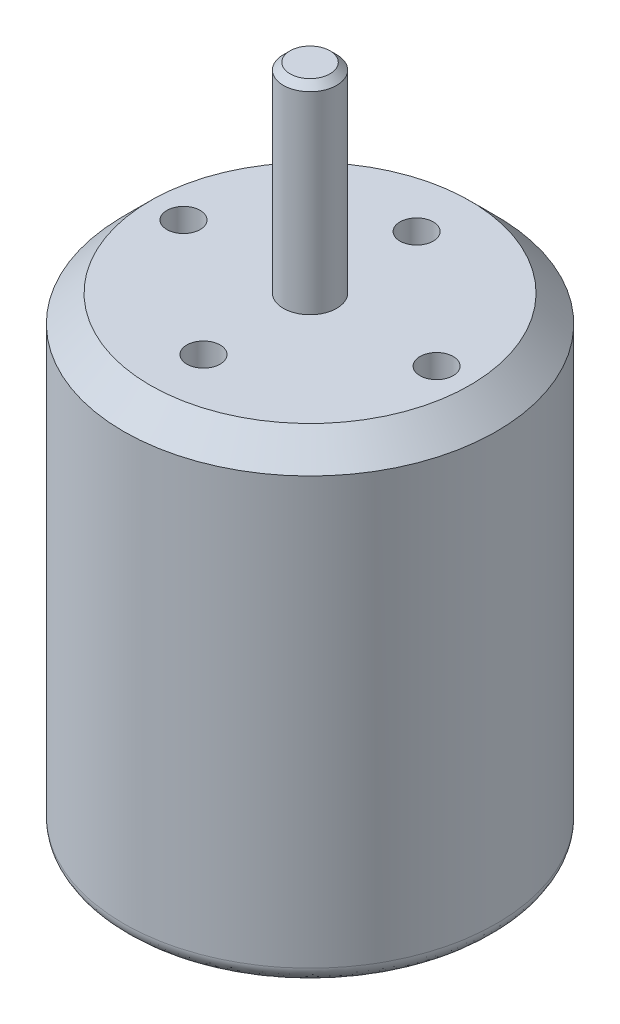
ISO-10303-21;
HEADER;
FILE_DESCRIPTION(('STEP AP214'),'2;1');
FILE_NAME('part.step','',(''),(''),'','','');
FILE_SCHEMA(('AUTOMOTIVE_DESIGN { 1 0 10303 214 1 1 1 1 }'));
ENDSEC;
DATA;
#1=APPLICATION_CONTEXT('core data for automotive mechanical design processes');
#2=APPLICATION_PROTOCOL_DEFINITION('international standard','automotive_design',2000,#1);
#3=PRODUCT_CONTEXT('',#1,'mechanical');
#4=PRODUCT('Part','Part','',(#3));
#5=PRODUCT_RELATED_PRODUCT_CATEGORY('part','',(#4));
#6=PRODUCT_DEFINITION_FORMATION('','',#4);
#7=PRODUCT_DEFINITION_CONTEXT('part definition',#1,'design');
#8=PRODUCT_DEFINITION('design','',#6,#7);
#9=PRODUCT_DEFINITION_SHAPE('','',#8);
#10=(LENGTH_UNIT() NAMED_UNIT(*) SI_UNIT(.MILLI.,.METRE.));
#11=(NAMED_UNIT(*) PLANE_ANGLE_UNIT() SI_UNIT($,.RADIAN.));
#12=(NAMED_UNIT(*) SI_UNIT($,.STERADIAN.) SOLID_ANGLE_UNIT());
#13=UNCERTAINTY_MEASURE_WITH_UNIT(LENGTH_MEASURE(1.E-05),#10,'distance_accuracy_value','');
#14=(GEOMETRIC_REPRESENTATION_CONTEXT(3) GLOBAL_UNCERTAINTY_ASSIGNED_CONTEXT((#13)) GLOBAL_UNIT_ASSIGNED_CONTEXT((#10,
#11,#12)) REPRESENTATION_CONTEXT('',''));
#15=CARTESIAN_POINT('',(0.,0.,0.));
#16=DIRECTION('',(0.,0.,1.));
#17=DIRECTION('',(1.,0.,0.));
#18=AXIS2_PLACEMENT_3D('',#15,#16,#17);
#19=CARTESIAN_POINT('',(0.,-36.,0.));
#20=DIRECTION('',(0.,1.,0.));
#21=DIRECTION('',(0.,0.,1.));
#22=AXIS2_PLACEMENT_3D('',#19,#20,#21);
#23=PLANE('',#22);
#24=CARTESIAN_POINT('',(6.,-36.,0.));
#25=DIRECTION('',(0.,-1.,0.));
#26=DIRECTION('',(0.,0.,-1.));
#27=AXIS2_PLACEMENT_3D('',#24,#25,#26);
#28=CIRCLE('',#27,1.24999999999999);
#29=CARTESIAN_POINT('',(6.,-36.,-1.24999999999999));
#30=VERTEX_POINT('',#29);
#31=EDGE_CURVE('E133',#30,#30,#28,.T.);
#32=ORIENTED_EDGE('',*,*,#31,.F.);
#33=EDGE_LOOP('',(#32));
#34=FACE_BOUND('',#33,.T.);
#35=CARTESIAN_POINT('',(0.,-36.,10.));
#36=CARTESIAN_POINT('',(1.30899693681416,-36.,10.));
#37=CARTESIAN_POINT('',(2.61747884560811,-36.,9.73972676584818));
#38=CARTESIAN_POINT('',(5.03618980169369,-36.,8.73786388437756));
#39=CARTESIAN_POINT('',(6.14546720129179,-36.,7.99666842243973));
#40=CARTESIAN_POINT('',(7.99666842243916,-36.,6.14546720129122));
#41=CARTESIAN_POINT('',(8.73786388437756,-36.,5.0361898016934));
#42=CARTESIAN_POINT('',(9.73972676584818,-36.,2.61747884560839));
#43=CARTESIAN_POINT('',(10.,-36.,1.30899693681409));
#44=CARTESIAN_POINT('',(10.,-36.,-1.30899693681408));
#45=CARTESIAN_POINT('',(9.73972676584818,-36.,-2.6174788456084));
#46=CARTESIAN_POINT('',(8.73786388437756,-36.,-5.03618980169341));
#47=CARTESIAN_POINT('',(7.99666842243823,-36.,-6.14546720129158));
#48=CARTESIAN_POINT('',(6.14546720129271,-36.,-7.99666842243938));
#49=CARTESIAN_POINT('',(5.036189801693,-36.,-8.73786388437753));
#50=CARTESIAN_POINT('',(2.61747884560882,-36.,-9.73972676584819));
#51=CARTESIAN_POINT('',(1.30899693681409,-36.,-10.));
#52=CARTESIAN_POINT('',(-1.30899693681408,-36.,-10.));
#53=CARTESIAN_POINT('',(-2.61747884560823,-36.,-9.73972676584707));
#54=CARTESIAN_POINT('',(-5.03618980169354,-36.,-8.73786388437868));
#55=CARTESIAN_POINT('',(-6.14546720129045,-36.,-7.99666842243937));
#56=CARTESIAN_POINT('',(-7.99666842244051,-36.,-6.14546720129157));
#57=CARTESIAN_POINT('',(-8.73786388437758,-36.,-5.03618980169355));
#58=CARTESIAN_POINT('',(-9.73972676584815,-36.,-2.61747884560827));
#59=CARTESIAN_POINT('',(-10.,-36.,-1.30899693681407));
#60=CARTESIAN_POINT('',(-10.,-36.,1.3089969368141));
#61=CARTESIAN_POINT('',(-9.73972676584816,-36.,2.61747884560825));
#62=CARTESIAN_POINT('',(-8.73786388437759,-36.,5.03618980169352));
#63=CARTESIAN_POINT('',(-7.99666842243896,-36.,6.14546720129199));
#64=CARTESIAN_POINT('',(-6.14546720129203,-36.,7.99666842243892));
#65=CARTESIAN_POINT('',(-5.03618980169355,-36.,8.73786388437758));
#66=CARTESIAN_POINT('',(-2.61747884560827,-36.,9.73972676584815));
#67=CARTESIAN_POINT('',(-1.30899693681417,-36.,10.));
#68=CARTESIAN_POINT('',(0.,-36.,10.));
#69=(BOUNDED_CURVE() B_SPLINE_CURVE(3,(#35,#36,#37,#38,#39,#40,#41,#42,#43,#44,#45,#46,#47,#48,
#49,#50,#51,#52,#53,#54,#55,#56,#57,#58,#59,#60,#61,#62,#63,#64,#65,#66,#67,#68),.UNSPECIFIED.,
.T.,.F.) B_SPLINE_CURVE_WITH_KNOTS((4,2,2,2,2,2,2,2,2,2,2,2,2,2,2,2,4),(0.,0.392699081698724,
0.785398163397448,1.17809724509617,1.5707963267949,1.96349540849362,2.35619449019234,
2.74889357189107,3.14159265358979,3.53429173528852,3.92699081698724,4.31968989868597,
4.71238898038469,5.10508806208341,5.49778714378214,5.89048622548086,6.28318530717959),
.UNSPECIFIED.) CURVE() GEOMETRIC_REPRESENTATION_ITEM() RATIONAL_B_SPLINE_CURVE((1.,1.,1.,1.,1.,
1.,1.,1.,1.,1.,1.,1.,1.,1.,1.,1.,1.,1.,1.,1.,1.,1.,1.,1.,1.,1.,1.,1.,1.,1.,1.,1.,1.,1.)) REPRESENTATION_ITEM(''));
#70=CARTESIAN_POINT('',(0.,-36.,10.));
#71=VERTEX_POINT('',#70);
#72=EDGE_CURVE('E12',#71,#71,#69,.F.);
#73=ORIENTED_EDGE('',*,*,#72,.T.);
#74=EDGE_LOOP('',(#73));
#75=FACE_BOUND('',#74,.T.);
#76=CARTESIAN_POINT('',(0.,-36.,0.));
#77=DIRECTION('',(0.,1.,0.));
#78=DIRECTION('',(0.,0.,1.));
#79=AXIS2_PLACEMENT_3D('',#76,#77,#78);
#80=CIRCLE('',#79,2.);
#81=CARTESIAN_POINT('',(0.,-36.,2.));
#82=VERTEX_POINT('',#81);
#83=EDGE_CURVE('E163',#82,#82,#80,.T.);
#84=ORIENTED_EDGE('',*,*,#83,.T.);
#85=EDGE_LOOP('',(#84));
#86=FACE_BOUND('',#85,.T.);
#87=CARTESIAN_POINT('',(-6.,-36.,0.));
#88=DIRECTION('',(0.,-1.,0.));
#89=DIRECTION('',(0.,0.,-1.));
#90=AXIS2_PLACEMENT_3D('',#87,#88,#89);
#91=CIRCLE('',#90,1.24999999999999);
#92=CARTESIAN_POINT('',(-6.,-36.,-1.24999999999999));
#93=VERTEX_POINT('',#92);
#94=EDGE_CURVE('E127',#93,#93,#91,.T.);
#95=ORIENTED_EDGE('',*,*,#94,.F.);
#96=EDGE_LOOP('',(#95));
#97=FACE_BOUND('',#96,.T.);
#98=CARTESIAN_POINT('',(5.19615242270662,-36.,3.00000000000003));
#99=DIRECTION('',(0.,-1.,0.));
#100=DIRECTION('',(0.,0.,-1.));
#101=AXIS2_PLACEMENT_3D('',#98,#99,#100);
#102=CIRCLE('',#101,1.02499999999999);
#103=CARTESIAN_POINT('',(5.19615242270662,-36.,1.97500000000004));
#104=VERTEX_POINT('',#103);
#105=EDGE_CURVE('E121',#104,#104,#102,.T.);
#106=ORIENTED_EDGE('',*,*,#105,.F.);
#107=EDGE_LOOP('',(#106));
#108=FACE_BOUND('',#107,.T.);
#109=CARTESIAN_POINT('',(-5.19615242270662,-36.,3.00000000000002));
#110=DIRECTION('',(0.,-1.,0.));
#111=DIRECTION('',(0.,0.,-1.));
#112=AXIS2_PLACEMENT_3D('',#109,#110,#111);
#113=CIRCLE('',#112,1.02499999999999);
#114=CARTESIAN_POINT('',(-5.19615242270662,-36.,1.97500000000003));
#115=VERTEX_POINT('',#114);
#116=EDGE_CURVE('E110',#115,#115,#113,.T.);
#117=ORIENTED_EDGE('',*,*,#116,.F.);
#118=EDGE_LOOP('',(#117));
#119=FACE_BOUND('',#118,.T.);
#120=CARTESIAN_POINT('',(0.,-36.,-6.));
#121=DIRECTION('',(0.,-1.,0.));
#122=DIRECTION('',(0.,0.,-1.));
#123=AXIS2_PLACEMENT_3D('',#120,#121,#122);
#124=CIRCLE('',#123,1.02499999999999);
#125=CARTESIAN_POINT('',(0.,-36.,-7.02499999999999));
#126=VERTEX_POINT('',#125);
#127=EDGE_CURVE('E111',#126,#126,#124,.T.);
#128=ORIENTED_EDGE('',*,*,#127,.F.);
#129=EDGE_LOOP('',(#128));
#130=FACE_BOUND('',#129,.T.);
#131=ADVANCED_FACE('F58',(#34,#75,#86,#97,#108,#119,#130),#23,.F.);
#132=CARTESIAN_POINT('',(0.,-36.,0.));
#133=DIRECTION('',(0.,1.,0.));
#134=DIRECTION('',(0.,0.,1.));
#135=AXIS2_PLACEMENT_3D('',#132,#133,#134);
#136=CYLINDRICAL_SURFACE('',#135,14.);
#137=CARTESIAN_POINT('',(0.,-34.,14.));
#138=CARTESIAN_POINT('',(-1.83259571153983,-34.,14.));
#139=CARTESIAN_POINT('',(-3.66447038385156,-34.,13.6356174721877));
#140=CARTESIAN_POINT('',(-7.05066572237099,-34.,12.2330094381284));
#141=CARTESIAN_POINT('',(-8.60365408180828,-34.,11.1953357914151));
#142=CARTESIAN_POINT('',(-11.1953357914151,-34.,8.60365408180821));
#143=CARTESIAN_POINT('',(-12.2330094381284,-34.,7.05066572237095));
#144=CARTESIAN_POINT('',(-13.6356174721877,-34.,3.66447038385152));
#145=CARTESIAN_POINT('',(-14.,-34.,1.83259571153974));
#146=CARTESIAN_POINT('',(-14.,-34.,-1.8325957115397));
#147=CARTESIAN_POINT('',(-13.6356174721877,-34.,-3.66447038385156));
#148=CARTESIAN_POINT('',(-12.2330094381284,-34.,-7.05066572237099));
#149=CARTESIAN_POINT('',(-11.1953357914156,-34.,-8.60365408180775));
#150=CARTESIAN_POINT('',(-8.60365408180776,-34.,-11.1953357914156));
#151=CARTESIAN_POINT('',(-7.05066572237014,-34.,-12.2330094381287));
#152=CARTESIAN_POINT('',(-3.66447038385234,-34.,-13.6356174721873));
#153=CARTESIAN_POINT('',(-1.83259571153972,-34.,-14.));
#154=CARTESIAN_POINT('',(1.83259571153972,-34.,-14.));
#155=CARTESIAN_POINT('',(3.66447038385246,-34.,-13.6356174721873));
#156=CARTESIAN_POINT('',(7.05066572237009,-34.,-12.2330094381287));
#157=CARTESIAN_POINT('',(8.60365408180888,-34.,-11.1953357914145));
#158=CARTESIAN_POINT('',(11.1953357914144,-34.,-8.6036540818089));
#159=CARTESIAN_POINT('',(12.2330094381285,-34.,-7.05066572237053));
#160=CARTESIAN_POINT('',(13.6356174721875,-34.,-3.66447038385199));
#161=CARTESIAN_POINT('',(14.,-34.,-1.83259571153972));
#162=CARTESIAN_POINT('',(14.,-34.,1.83259571153972));
#163=CARTESIAN_POINT('',(13.6356174721875,-34.,3.66447038385198));
#164=CARTESIAN_POINT('',(12.2330094381286,-34.,7.05066572237052));
#165=CARTESIAN_POINT('',(11.1953357914151,-34.,8.60365408180828));
#166=CARTESIAN_POINT('',(8.60365408180828,-34.,11.1953357914151));
#167=CARTESIAN_POINT('',(7.05066572237149,-34.,12.2330094381281));
#168=CARTESIAN_POINT('',(3.66447038385102,-34.,13.6356174721879));
#169=CARTESIAN_POINT('',(1.83259571153983,-34.,14.));
#170=CARTESIAN_POINT('',(0.,-34.,14.));
#171=(BOUNDED_CURVE() B_SPLINE_CURVE(3,(#137,#138,#139,#140,#141,#142,#143,#144,#145,#146,#147,
#148,#149,#150,#151,#152,#153,#154,#155,#156,#157,#158,#159,#160,#161,#162,#163,#164,#165,#166,
#167,#168,#169,#170),.UNSPECIFIED.,.T.,.F.) B_SPLINE_CURVE_WITH_KNOTS((4,2,2,2,2,2,2,2,2,2,2,2,
2,2,2,2,4),(0.,0.392699081698725,0.785398163397448,1.17809724509617,1.5707963267949,
1.96349540849362,2.35619449019234,2.74889357189107,3.14159265358979,3.53429173528852,
3.92699081698724,4.31968989868597,4.71238898038469,5.10508806208341,5.49778714378214,
5.89048622548086,6.28318530717959),
.UNSPECIFIED.) CURVE() GEOMETRIC_REPRESENTATION_ITEM() RATIONAL_B_SPLINE_CURVE((1.,1.,1.,1.,1.,
1.,1.,1.,1.,1.,1.,1.,1.,1.,1.,1.,1.,1.,1.,1.,1.,1.,1.,1.,1.,1.,1.,1.,1.,1.,1.,1.,1.,1.)) REPRESENTATION_ITEM(''));
#172=CARTESIAN_POINT('',(0.,-34.,14.));
#173=VERTEX_POINT('',#172);
#174=EDGE_CURVE('E72',#173,#173,#171,.F.);
#175=ORIENTED_EDGE('',*,*,#174,.T.);
#176=EDGE_LOOP('',(#175));
#177=FACE_BOUND('',#176,.T.);
#178=CARTESIAN_POINT('',(0.,-1.99999999999999,0.));
#179=DIRECTION('',(0.,1.,0.));
#180=DIRECTION('',(0.,0.,1.));
#181=AXIS2_PLACEMENT_3D('',#178,#179,#180);
#182=CIRCLE('',#181,14.);
#183=CARTESIAN_POINT('',(0.,-1.99999999999999,14.));
#184=VERTEX_POINT('',#183);
#185=EDGE_CURVE('E184',#184,#184,#182,.F.);
#186=ORIENTED_EDGE('',*,*,#185,.T.);
#187=EDGE_LOOP('',(#186));
#188=FACE_BOUND('',#187,.T.);
#189=ADVANCED_FACE('F196',(#177,#188),#136,.T.);
#190=CARTESIAN_POINT('',(0.,0.,0.));
#191=DIRECTION('',(0.,1.,0.));
#192=DIRECTION('',(0.,0.,1.));
#193=AXIS2_PLACEMENT_3D('',#190,#191,#192);
#194=PLANE('',#193);
#195=CARTESIAN_POINT('',(0.,0.,8.));
#196=DIRECTION('',(0.,1.,0.));
#197=DIRECTION('',(0.,0.,1.));
#198=AXIS2_PLACEMENT_3D('',#195,#196,#197);
#199=CIRCLE('',#198,1.24999999999999);
#200=CARTESIAN_POINT('',(0.,0.,9.24999999999999));
#201=VERTEX_POINT('',#200);
#202=EDGE_CURVE('E139',#201,#201,#199,.T.);
#203=ORIENTED_EDGE('',*,*,#202,.F.);
#204=EDGE_LOOP('',(#203));
#205=FACE_BOUND('',#204,.T.);
#206=CARTESIAN_POINT('',(-9.5,0.,0.));
#207=DIRECTION('',(0.,1.,0.));
#208=DIRECTION('',(0.,0.,1.));
#209=AXIS2_PLACEMENT_3D('',#206,#207,#208);
#210=CIRCLE('',#209,1.24999999999999);
#211=CARTESIAN_POINT('',(-9.5,0.,1.24999999999999));
#212=VERTEX_POINT('',#211);
#213=EDGE_CURVE('E145',#212,#212,#210,.T.);
#214=ORIENTED_EDGE('',*,*,#213,.F.);
#215=EDGE_LOOP('',(#214));
#216=FACE_BOUND('',#215,.T.);
#217=CARTESIAN_POINT('',(0.,0.,-8.));
#218=DIRECTION('',(0.,1.,0.));
#219=DIRECTION('',(0.,0.,1.));
#220=AXIS2_PLACEMENT_3D('',#217,#218,#219);
#221=CIRCLE('',#220,1.24999999999999);
#222=CARTESIAN_POINT('',(0.,0.,-6.75000000000001));
#223=VERTEX_POINT('',#222);
#224=EDGE_CURVE('E151',#223,#223,#221,.T.);
#225=ORIENTED_EDGE('',*,*,#224,.F.);
#226=EDGE_LOOP('',(#225));
#227=FACE_BOUND('',#226,.T.);
#228=CARTESIAN_POINT('',(9.5,0.,0.));
#229=DIRECTION('',(0.,1.,0.));
#230=DIRECTION('',(0.,0.,1.));
#231=AXIS2_PLACEMENT_3D('',#228,#229,#230);
#232=CIRCLE('',#231,1.24999999999999);
#233=CARTESIAN_POINT('',(9.5,0.,1.24999999999999));
#234=VERTEX_POINT('',#233);
#235=EDGE_CURVE('E157',#234,#234,#232,.T.);
#236=ORIENTED_EDGE('',*,*,#235,.F.);
#237=EDGE_LOOP('',(#236));
#238=FACE_BOUND('',#237,.T.);
#239=CARTESIAN_POINT('',(0.,0.,0.));
#240=DIRECTION('',(0.,1.,0.));
#241=DIRECTION('',(0.,0.,1.));
#242=AXIS2_PLACEMENT_3D('',#239,#240,#241);
#243=CIRCLE('',#242,12.);
#244=CARTESIAN_POINT('',(0.,0.,12.));
#245=VERTEX_POINT('',#244);
#246=EDGE_CURVE('E181',#245,#245,#243,.T.);
#247=ORIENTED_EDGE('',*,*,#246,.T.);
#248=EDGE_LOOP('',(#247));
#249=FACE_BOUND('',#248,.T.);
#250=CARTESIAN_POINT('',(0.,0.,0.));
#251=DIRECTION('',(0.,1.,0.));
#252=DIRECTION('',(0.,0.,1.));
#253=AXIS2_PLACEMENT_3D('',#250,#251,#252);
#254=CIRCLE('',#253,2.);
#255=CARTESIAN_POINT('',(0.,0.,2.));
#256=VERTEX_POINT('',#255);
#257=EDGE_CURVE('E166',#256,#256,#254,.T.);
#258=ORIENTED_EDGE('',*,*,#257,.F.);
#259=EDGE_LOOP('',(#258));
#260=FACE_BOUND('',#259,.T.);
#261=ADVANCED_FACE('F206',(#205,#216,#227,#238,#249,#260),#194,.T.);
#262=CARTESIAN_POINT('',(0.,15.,0.));
#263=DIRECTION('',(0.,-1.,0.));
#264=DIRECTION('',(0.,0.,-1.));
#265=AXIS2_PLACEMENT_3D('',#262,#263,#264);
#266=CYLINDRICAL_SURFACE('',#265,2.);
#267=CARTESIAN_POINT('',(0.,14.5,0.));
#268=DIRECTION('',(0.,1.,0.));
#269=DIRECTION('',(0.,0.,1.));
#270=AXIS2_PLACEMENT_3D('',#267,#268,#269);
#271=CIRCLE('',#270,2.);
#272=CARTESIAN_POINT('',(0.,14.5,2.));
#273=VERTEX_POINT('',#272);
#274=EDGE_CURVE('E178',#273,#273,#271,.F.);
#275=ORIENTED_EDGE('',*,*,#274,.T.);
#276=EDGE_LOOP('',(#275));
#277=FACE_BOUND('',#276,.T.);
#278=ORIENTED_EDGE('',*,*,#257,.T.);
#279=EDGE_LOOP('',(#278));
#280=FACE_BOUND('',#279,.T.);
#281=ADVANCED_FACE('F243',(#277,#280),#266,.T.);
#282=CARTESIAN_POINT('',(0.,15.,0.));
#283=DIRECTION('',(0.,1.,0.));
#284=DIRECTION('',(0.,0.,1.));
#285=AXIS2_PLACEMENT_3D('',#282,#283,#284);
#286=PLANE('',#285);
#287=CARTESIAN_POINT('',(0.,15.,0.));
#288=DIRECTION('',(0.,1.,0.));
#289=DIRECTION('',(0.,0.,1.));
#290=AXIS2_PLACEMENT_3D('',#287,#288,#289);
#291=CIRCLE('',#290,1.50000000000002);
#292=CARTESIAN_POINT('',(0.,15.,1.50000000000002));
#293=VERTEX_POINT('',#292);
#294=EDGE_CURVE('E175',#293,#293,#291,.T.);
#295=ORIENTED_EDGE('',*,*,#294,.T.);
#296=EDGE_LOOP('',(#295));
#297=FACE_BOUND('',#296,.T.);
#298=ADVANCED_FACE('F344',(#297),#286,.T.);
#299=CARTESIAN_POINT('',(0.,-38.,0.));
#300=DIRECTION('',(0.,1.,0.));
#301=DIRECTION('',(0.,0.,1.));
#302=AXIS2_PLACEMENT_3D('',#299,#300,#301);
#303=CYLINDRICAL_SURFACE('',#302,2.);
#304=CARTESIAN_POINT('',(0.,-37.5,0.));
#305=DIRECTION('',(0.,1.,0.));
#306=DIRECTION('',(0.,0.,1.));
#307=AXIS2_PLACEMENT_3D('',#304,#305,#306);
#308=CIRCLE('',#307,2.);
#309=CARTESIAN_POINT('',(0.,-37.5,2.));
#310=VERTEX_POINT('',#309);
#311=EDGE_CURVE('E169',#310,#310,#308,.T.);
#312=ORIENTED_EDGE('',*,*,#311,.T.);
#313=EDGE_LOOP('',(#312));
#314=FACE_BOUND('',#313,.T.);
#315=ORIENTED_EDGE('',*,*,#83,.F.);
#316=EDGE_LOOP('',(#315));
#317=FACE_BOUND('',#316,.T.);
#318=ADVANCED_FACE('F341',(#314,#317),#303,.T.);
#319=CARTESIAN_POINT('',(0.,-38.,0.));
#320=DIRECTION('',(0.,1.,0.));
#321=DIRECTION('',(0.,0.,1.));
#322=AXIS2_PLACEMENT_3D('',#319,#320,#321);
#323=PLANE('',#322);
#324=CARTESIAN_POINT('',(0.,-38.,0.));
#325=DIRECTION('',(0.,1.,0.));
#326=DIRECTION('',(0.,0.,1.));
#327=AXIS2_PLACEMENT_3D('',#324,#325,#326);
#328=CIRCLE('',#327,1.49999999999999);
#329=CARTESIAN_POINT('',(0.,-38.,1.49999999999999));
#330=VERTEX_POINT('',#329);
#331=EDGE_CURVE('E172',#330,#330,#328,.F.);
#332=ORIENTED_EDGE('',*,*,#331,.T.);
#333=EDGE_LOOP('',(#332));
#334=FACE_BOUND('',#333,.T.);
#335=ADVANCED_FACE('F216',(#334),#323,.F.);
#336=CARTESIAN_POINT('',(0.,-37.5,0.));
#337=DIRECTION('',(0.,1.,0.));
#338=DIRECTION('',(0.,0.,1.));
#339=AXIS2_PLACEMENT_3D('',#336,#337,#338);
#340=CONICAL_SURFACE('',#339,2.,0.785398163397454);
#341=ORIENTED_EDGE('',*,*,#331,.F.);
#342=EDGE_LOOP('',(#341));
#343=FACE_BOUND('',#342,.T.);
#344=ORIENTED_EDGE('',*,*,#311,.F.);
#345=EDGE_LOOP('',(#344));
#346=FACE_BOUND('',#345,.T.);
#347=ADVANCED_FACE('F209',(#343,#346),#340,.T.);
#348=CARTESIAN_POINT('',(0.,15.,0.));
#349=DIRECTION('',(0.,-1.,0.));
#350=DIRECTION('',(0.,0.,-1.));
#351=AXIS2_PLACEMENT_3D('',#348,#349,#350);
#352=CONICAL_SURFACE('',#351,1.50000000000002,0.785398163397442);
#353=ORIENTED_EDGE('',*,*,#274,.F.);
#354=EDGE_LOOP('',(#353));
#355=FACE_BOUND('',#354,.T.);
#356=ORIENTED_EDGE('',*,*,#294,.F.);
#357=EDGE_LOOP('',(#356));
#358=FACE_BOUND('',#357,.T.);
#359=ADVANCED_FACE('F215',(#355,#358),#352,.T.);
#360=CARTESIAN_POINT('',(0.,0.,0.));
#361=DIRECTION('',(0.,-1.,0.));
#362=DIRECTION('',(0.,0.,-1.));
#363=AXIS2_PLACEMENT_3D('',#360,#361,#362);
#364=CONICAL_SURFACE('',#363,12.,0.785398163397449);
#365=ORIENTED_EDGE('',*,*,#185,.F.);
#366=EDGE_LOOP('',(#365));
#367=FACE_BOUND('',#366,.T.);
#368=ORIENTED_EDGE('',*,*,#246,.F.);
#369=EDGE_LOOP('',(#368));
#370=FACE_BOUND('',#369,.T.);
#371=ADVANCED_FACE('F222',(#367,#370),#364,.T.);
#372=CARTESIAN_POINT('',(0.,-34.,14.));
#373=CARTESIAN_POINT('',(1.83259571153983,-34.,14.));
#374=CARTESIAN_POINT('',(3.66447038385102,-34.,13.6356174721879));
#375=CARTESIAN_POINT('',(7.05066572237149,-34.,12.2330094381281));
#376=CARTESIAN_POINT('',(8.60365408180828,-34.,11.1953357914151));
#377=CARTESIAN_POINT('',(11.1953357914151,-34.,8.60365408180828));
#378=CARTESIAN_POINT('',(12.2330094381286,-34.,7.05066572237052));
#379=CARTESIAN_POINT('',(13.6356174721875,-34.,3.66447038385198));
#380=CARTESIAN_POINT('',(14.,-34.,1.83259571153972));
#381=CARTESIAN_POINT('',(14.,-34.,-1.83259571153972));
#382=CARTESIAN_POINT('',(13.6356174721875,-34.,-3.66447038385199));
#383=CARTESIAN_POINT('',(12.2330094381285,-34.,-7.05066572237053));
#384=CARTESIAN_POINT('',(11.1953357914144,-34.,-8.6036540818089));
#385=CARTESIAN_POINT('',(8.60365408180888,-34.,-11.1953357914145));
#386=CARTESIAN_POINT('',(7.05066572237009,-34.,-12.2330094381287));
#387=CARTESIAN_POINT('',(3.66447038385246,-34.,-13.6356174721873));
#388=CARTESIAN_POINT('',(1.83259571153972,-34.,-14.));
#389=CARTESIAN_POINT('',(-1.83259571153972,-34.,-14.));
#390=CARTESIAN_POINT('',(-3.66447038385234,-34.,-13.6356174721873));
#391=CARTESIAN_POINT('',(-7.05066572237014,-34.,-12.2330094381287));
#392=CARTESIAN_POINT('',(-8.60365408180776,-34.,-11.1953357914156));
#393=CARTESIAN_POINT('',(-11.1953357914156,-34.,-8.60365408180775));
#394=CARTESIAN_POINT('',(-12.2330094381284,-34.,-7.05066572237099));
#395=CARTESIAN_POINT('',(-13.6356174721877,-34.,-3.66447038385156));
#396=CARTESIAN_POINT('',(-14.,-34.,-1.8325957115397));
#397=CARTESIAN_POINT('',(-14.,-34.,1.83259571153974));
#398=CARTESIAN_POINT('',(-13.6356174721877,-34.,3.66447038385152));
#399=CARTESIAN_POINT('',(-12.2330094381284,-34.,7.05066572237095));
#400=CARTESIAN_POINT('',(-11.1953357914151,-34.,8.60365408180821));
#401=CARTESIAN_POINT('',(-8.60365408180828,-34.,11.1953357914151));
#402=CARTESIAN_POINT('',(-7.05066572237099,-34.,12.2330094381284));
#403=CARTESIAN_POINT('',(-3.66447038385156,-34.,13.6356174721877));
#404=CARTESIAN_POINT('',(-1.83259571153983,-34.,14.));
#405=CARTESIAN_POINT('',(0.,-34.,14.));
#406=CARTESIAN_POINT('',(0.,-36.,14.));
#407=CARTESIAN_POINT('',(1.83259571153983,-36.,14.));
#408=CARTESIAN_POINT('',(3.66447038385084,-36.,13.6356174721874));
#409=CARTESIAN_POINT('',(7.05066572237167,-36.,12.2330094381286));
#410=CARTESIAN_POINT('',(8.60365408180771,-36.,11.1953357914145));
#411=CARTESIAN_POINT('',(11.1953357914156,-36.,8.60365408180885));
#412=CARTESIAN_POINT('',(12.2330094381286,-36.,7.05066572237053));
#413=CARTESIAN_POINT('',(13.6356174721874,-36.,3.66447038385197));
#414=CARTESIAN_POINT('',(14.,-36.,1.83259571153972));
#415=CARTESIAN_POINT('',(14.,-36.,-1.83259571153972));
#416=CARTESIAN_POINT('',(13.6356174721874,-36.,-3.66447038385198));
#417=CARTESIAN_POINT('',(12.2330094381286,-36.,-7.05066572237054));
#418=CARTESIAN_POINT('',(11.195335791415,-36.,-8.60365408180833));
#419=CARTESIAN_POINT('',(8.60365408180831,-36.,-11.195335791415));
#420=CARTESIAN_POINT('',(7.05066572236964,-36.,-12.233009438129));
#421=CARTESIAN_POINT('',(3.66447038385292,-36.,-13.635617472187));
#422=CARTESIAN_POINT('',(1.83259571153972,-36.,-14.));
#423=CARTESIAN_POINT('',(-1.83259571153972,-36.,-14.));
#424=CARTESIAN_POINT('',(-3.66447038385174,-36.,-13.6356174721859));
#425=CARTESIAN_POINT('',(-7.05066572237073,-36.,-12.2330094381301));
#426=CARTESIAN_POINT('',(-8.60365408180719,-36.,-11.1953357914161));
#427=CARTESIAN_POINT('',(-11.1953357914162,-36.,-8.60365408180718));
#428=CARTESIAN_POINT('',(-12.2330094381282,-36.,-7.05066572237091));
#429=CARTESIAN_POINT('',(-13.6356174721879,-36.,-3.66447038385164));
#430=CARTESIAN_POINT('',(-14.,-36.,-1.8325957115397));
#431=CARTESIAN_POINT('',(-14.,-36.,1.83259571153974));
#432=CARTESIAN_POINT('',(-13.6356174721879,-36.,3.6644703838516));
#433=CARTESIAN_POINT('',(-12.2330094381282,-36.,7.05066572237087));
#434=CARTESIAN_POINT('',(-11.1953357914151,-36.,8.60365408180822));
#435=CARTESIAN_POINT('',(-8.60365408180827,-36.,11.1953357914151));
#436=CARTESIAN_POINT('',(-7.05066572237091,-36.,12.2330094381282));
#437=CARTESIAN_POINT('',(-3.66447038385164,-36.,13.6356174721879));
#438=CARTESIAN_POINT('',(-1.83259571153983,-36.,14.));
#439=CARTESIAN_POINT('',(0.,-36.,14.));
#440=CARTESIAN_POINT('',(0.,-36.,10.));
#441=CARTESIAN_POINT('',(1.30899693681416,-36.,10.));
#442=CARTESIAN_POINT('',(2.61747884560811,-36.,9.73972676584818));
#443=CARTESIAN_POINT('',(5.03618980169369,-36.,8.73786388437756));
#444=CARTESIAN_POINT('',(6.14546720129179,-36.,7.99666842243973));
#445=CARTESIAN_POINT('',(7.99666842243916,-36.,6.14546720129122));
#446=CARTESIAN_POINT('',(8.73786388437756,-36.,5.0361898016934));
#447=CARTESIAN_POINT('',(9.73972676584818,-36.,2.61747884560839));
#448=CARTESIAN_POINT('',(10.,-36.,1.30899693681409));
#449=CARTESIAN_POINT('',(10.,-36.,-1.30899693681408));
#450=CARTESIAN_POINT('',(9.73972676584818,-36.,-2.6174788456084));
#451=CARTESIAN_POINT('',(8.73786388437756,-36.,-5.03618980169341));
#452=CARTESIAN_POINT('',(7.99666842243823,-36.,-6.14546720129158));
#453=CARTESIAN_POINT('',(6.14546720129271,-36.,-7.99666842243938));
#454=CARTESIAN_POINT('',(5.036189801693,-36.,-8.73786388437753));
#455=CARTESIAN_POINT('',(2.61747884560882,-36.,-9.73972676584819));
#456=CARTESIAN_POINT('',(1.30899693681409,-36.,-10.));
#457=CARTESIAN_POINT('',(-1.30899693681408,-36.,-10.));
#458=CARTESIAN_POINT('',(-2.61747884560823,-36.,-9.73972676584707));
#459=CARTESIAN_POINT('',(-5.03618980169354,-36.,-8.73786388437868));
#460=CARTESIAN_POINT('',(-6.14546720129045,-36.,-7.99666842243937));
#461=CARTESIAN_POINT('',(-7.99666842244051,-36.,-6.14546720129157));
#462=CARTESIAN_POINT('',(-8.73786388437758,-36.,-5.03618980169355));
#463=CARTESIAN_POINT('',(-9.73972676584815,-36.,-2.61747884560827));
#464=CARTESIAN_POINT('',(-10.,-36.,-1.30899693681407));
#465=CARTESIAN_POINT('',(-10.,-36.,1.3089969368141));
#466=CARTESIAN_POINT('',(-9.73972676584816,-36.,2.61747884560825));
#467=CARTESIAN_POINT('',(-8.73786388437759,-36.,5.03618980169352));
#468=CARTESIAN_POINT('',(-7.99666842243896,-36.,6.14546720129199));
#469=CARTESIAN_POINT('',(-6.14546720129203,-36.,7.99666842243892));
#470=CARTESIAN_POINT('',(-5.03618980169355,-36.,8.73786388437758));
#471=CARTESIAN_POINT('',(-2.61747884560827,-36.,9.73972676584815));
#472=CARTESIAN_POINT('',(-1.30899693681417,-36.,10.));
#473=CARTESIAN_POINT('',(0.,-36.,10.));
#474=(BOUNDED_SURFACE() B_SPLINE_SURFACE(2,3,((#372,#373,#374,#375,#376,#377,#378,#379,#380,
#381,#382,#383,#384,#385,#386,#387,#388,#389,#390,#391,#392,#393,#394,#395,#396,#397,#398,#399,
#400,#401,#402,#403,#404,#405),(#406,#407,#408,#409,#410,#411,#412,#413,#414,#415,#416,#417,
#418,#419,#420,#421,#422,#423,#424,#425,#426,#427,#428,#429,#430,#431,#432,#433,#434,#435,#436,
#437,#438,#439),(#440,#441,#442,#443,#444,#445,#446,#447,#448,#449,#450,#451,#452,#453,#454,
#455,#456,#457,#458,#459,#460,#461,#462,#463,#464,#465,#466,#467,#468,#469,#470,#471,#472,
#473)),.UNSPECIFIED.,.F.,.T.,.F.) B_SPLINE_SURFACE_WITH_KNOTS((3,3),(4,2,2,2,2,2,2,2,2,2,2,2,2,
2,2,2,4),(0.,1.),(0.,0.392699081698724,0.785398163397448,1.17809724509617,1.5707963267949,
1.96349540849362,2.35619449019234,2.74889357189107,3.14159265358979,3.53429173528852,
3.92699081698724,4.31968989868597,4.71238898038469,5.10508806208341,5.49778714378214,
5.89048622548086,6.28318530717959),
.UNSPECIFIED.) GEOMETRIC_REPRESENTATION_ITEM() RATIONAL_B_SPLINE_SURFACE(((1.,1.,1.,1.,1.,1.,1.,
1.,1.,1.,1.,1.,1.,1.,1.,1.,1.,1.,1.,1.,1.,1.,1.,1.,1.,1.,1.,1.,1.,1.,1.,1.,1.,1.),
(0.707106781186548,0.707106781186548,0.707106781186548,0.707106781186548,0.707106781186548,
0.707106781186548,0.707106781186548,0.707106781186548,0.707106781186548,0.707106781186548,
0.707106781186548,0.707106781186548,0.707106781186548,0.707106781186548,0.707106781186548,
0.707106781186548,0.707106781186548,0.707106781186548,0.707106781186548,0.707106781186548,
0.707106781186548,0.707106781186548,0.707106781186548,0.707106781186548,0.707106781186548,
0.707106781186548,0.707106781186548,0.707106781186548,0.707106781186548,0.707106781186548,
0.707106781186548,0.707106781186548,0.707106781186548,0.707106781186548),(1.,1.,1.,1.,1.,1.,1.,
1.,1.,1.,1.,1.,1.,1.,1.,1.,1.,1.,1.,1.,1.,1.,1.,1.,1.,1.,1.,1.,1.,1.,1.,1.,1.,1.))) REPRESENTATION_ITEM('') SURFACE());
#475=ORIENTED_EDGE('',*,*,#72,.F.);
#476=EDGE_LOOP('',(#475));
#477=FACE_BOUND('',#476,.T.);
#478=ORIENTED_EDGE('',*,*,#174,.F.);
#479=EDGE_LOOP('',(#478));
#480=FACE_BOUND('',#479,.T.);
#481=ADVANCED_FACE('F61',(#477,#480),#474,.T.);
#482=CARTESIAN_POINT('',(9.5,-4.,0.));
#483=DIRECTION('',(0.,1.,0.));
#484=DIRECTION('',(0.,0.,1.));
#485=AXIS2_PLACEMENT_3D('',#482,#483,#484);
#486=CONICAL_SURFACE('',#485,1.24999999999999,1.02974425867665);
#487=CARTESIAN_POINT('',(9.5,-4.75107577378445,0.));
#488=VERTEX_POINT('',#487);
#489=VERTEX_LOOP('',#488);
#490=FACE_BOUND('',#489,.T.);
#491=CARTESIAN_POINT('',(9.5,-4.,0.));
#492=DIRECTION('',(0.,1.,0.));
#493=DIRECTION('',(0.,0.,1.));
#494=AXIS2_PLACEMENT_3D('',#491,#492,#493);
#495=CIRCLE('',#494,1.24999999999999);
#496=CARTESIAN_POINT('',(9.5,-4.,1.24999999999999));
#497=VERTEX_POINT('',#496);
#498=EDGE_CURVE('E160',#497,#497,#495,.T.);
#499=ORIENTED_EDGE('',*,*,#498,.T.);
#500=EDGE_LOOP('',(#499));
#501=FACE_BOUND('',#500,.T.);
#502=ADVANCED_FACE('F231',(#490,#501),#486,.F.);
#503=CARTESIAN_POINT('',(9.5,0.,0.));
#504=DIRECTION('',(0.,1.,0.));
#505=DIRECTION('',(0.,0.,1.));
#506=AXIS2_PLACEMENT_3D('',#503,#504,#505);
#507=CYLINDRICAL_SURFACE('',#506,1.24999999999999);
#508=ORIENTED_EDGE('',*,*,#498,.F.);
#509=EDGE_LOOP('',(#508));
#510=FACE_BOUND('',#509,.T.);
#511=ORIENTED_EDGE('',*,*,#235,.T.);
#512=EDGE_LOOP('',(#511));
#513=FACE_BOUND('',#512,.T.);
#514=ADVANCED_FACE('F333',(#510,#513),#507,.F.);
#515=CARTESIAN_POINT('',(0.,-4.,-8.));
#516=DIRECTION('',(0.,1.,0.));
#517=DIRECTION('',(0.,0.,1.));
#518=AXIS2_PLACEMENT_3D('',#515,#516,#517);
#519=CONICAL_SURFACE('',#518,1.24999999999999,1.02974425867665);
#520=CARTESIAN_POINT('',(0.,-4.75107577378445,-8.));
#521=VERTEX_POINT('',#520);
#522=VERTEX_LOOP('',#521);
#523=FACE_BOUND('',#522,.T.);
#524=CARTESIAN_POINT('',(0.,-4.,-8.));
#525=DIRECTION('',(0.,1.,0.));
#526=DIRECTION('',(0.,0.,1.));
#527=AXIS2_PLACEMENT_3D('',#524,#525,#526);
#528=CIRCLE('',#527,1.24999999999999);
#529=CARTESIAN_POINT('',(0.,-4.,-6.75000000000001));
#530=VERTEX_POINT('',#529);
#531=EDGE_CURVE('E154',#530,#530,#528,.T.);
#532=ORIENTED_EDGE('',*,*,#531,.T.);
#533=EDGE_LOOP('',(#532));
#534=FACE_BOUND('',#533,.T.);
#535=ADVANCED_FACE('F329',(#523,#534),#519,.F.);
#536=CARTESIAN_POINT('',(0.,0.,-8.));
#537=DIRECTION('',(0.,1.,0.));
#538=DIRECTION('',(0.,0.,1.));
#539=AXIS2_PLACEMENT_3D('',#536,#537,#538);
#540=CYLINDRICAL_SURFACE('',#539,1.24999999999999);
#541=ORIENTED_EDGE('',*,*,#531,.F.);
#542=EDGE_LOOP('',(#541));
#543=FACE_BOUND('',#542,.T.);
#544=ORIENTED_EDGE('',*,*,#224,.T.);
#545=EDGE_LOOP('',(#544));
#546=FACE_BOUND('',#545,.T.);
#547=ADVANCED_FACE('F325',(#543,#546),#540,.F.);
#548=CARTESIAN_POINT('',(-9.5,-4.,0.));
#549=DIRECTION('',(0.,1.,0.));
#550=DIRECTION('',(0.,0.,1.));
#551=AXIS2_PLACEMENT_3D('',#548,#549,#550);
#552=CONICAL_SURFACE('',#551,1.24999999999999,1.02974425867665);
#553=CARTESIAN_POINT('',(-9.5,-4.75107577378445,0.));
#554=VERTEX_POINT('',#553);
#555=VERTEX_LOOP('',#554);
#556=FACE_BOUND('',#555,.T.);
#557=CARTESIAN_POINT('',(-9.5,-4.,0.));
#558=DIRECTION('',(0.,1.,0.));
#559=DIRECTION('',(0.,0.,1.));
#560=AXIS2_PLACEMENT_3D('',#557,#558,#559);
#561=CIRCLE('',#560,1.24999999999999);
#562=CARTESIAN_POINT('',(-9.5,-4.,1.24999999999999));
#563=VERTEX_POINT('',#562);
#564=EDGE_CURVE('E148',#563,#563,#561,.T.);
#565=ORIENTED_EDGE('',*,*,#564,.T.);
#566=EDGE_LOOP('',(#565));
#567=FACE_BOUND('',#566,.T.);
#568=ADVANCED_FACE('F321',(#556,#567),#552,.F.);
#569=CARTESIAN_POINT('',(-9.5,0.,0.));
#570=DIRECTION('',(0.,1.,0.));
#571=DIRECTION('',(0.,0.,1.));
#572=AXIS2_PLACEMENT_3D('',#569,#570,#571);
#573=CYLINDRICAL_SURFACE('',#572,1.24999999999999);
#574=ORIENTED_EDGE('',*,*,#564,.F.);
#575=EDGE_LOOP('',(#574));
#576=FACE_BOUND('',#575,.T.);
#577=ORIENTED_EDGE('',*,*,#213,.T.);
#578=EDGE_LOOP('',(#577));
#579=FACE_BOUND('',#578,.T.);
#580=ADVANCED_FACE('F317',(#576,#579),#573,.F.);
#581=CARTESIAN_POINT('',(0.,-4.,8.));
#582=DIRECTION('',(0.,1.,0.));
#583=DIRECTION('',(0.,0.,1.));
#584=AXIS2_PLACEMENT_3D('',#581,#582,#583);
#585=CONICAL_SURFACE('',#584,1.24999999999999,1.02974425867665);
#586=CARTESIAN_POINT('',(0.,-4.75107577378445,8.));
#587=VERTEX_POINT('',#586);
#588=VERTEX_LOOP('',#587);
#589=FACE_BOUND('',#588,.T.);
#590=CARTESIAN_POINT('',(0.,-4.,8.));
#591=DIRECTION('',(0.,1.,0.));
#592=DIRECTION('',(0.,0.,1.));
#593=AXIS2_PLACEMENT_3D('',#590,#591,#592);
#594=CIRCLE('',#593,1.24999999999999);
#595=CARTESIAN_POINT('',(0.,-4.,9.24999999999999));
#596=VERTEX_POINT('',#595);
#597=EDGE_CURVE('E142',#596,#596,#594,.T.);
#598=ORIENTED_EDGE('',*,*,#597,.T.);
#599=EDGE_LOOP('',(#598));
#600=FACE_BOUND('',#599,.T.);
#601=ADVANCED_FACE('F313',(#589,#600),#585,.F.);
#602=CARTESIAN_POINT('',(0.,0.,8.));
#603=DIRECTION('',(0.,1.,0.));
#604=DIRECTION('',(0.,0.,1.));
#605=AXIS2_PLACEMENT_3D('',#602,#603,#604);
#606=CYLINDRICAL_SURFACE('',#605,1.24999999999999);
#607=ORIENTED_EDGE('',*,*,#597,.F.);
#608=EDGE_LOOP('',(#607));
#609=FACE_BOUND('',#608,.T.);
#610=ORIENTED_EDGE('',*,*,#202,.T.);
#611=EDGE_LOOP('',(#610));
#612=FACE_BOUND('',#611,.T.);
#613=ADVANCED_FACE('F309',(#609,#612),#606,.F.);
#614=CARTESIAN_POINT('',(6.,-32.,0.));
#615=DIRECTION('',(0.,-1.,0.));
#616=DIRECTION('',(0.,0.,-1.));
#617=AXIS2_PLACEMENT_3D('',#614,#615,#616);
#618=CONICAL_SURFACE('',#617,1.25,1.02974425867665);
#619=CARTESIAN_POINT('',(6.,-31.2489242262155,0.));
#620=VERTEX_POINT('',#619);
#621=VERTEX_LOOP('',#620);
#622=FACE_BOUND('',#621,.T.);
#623=CARTESIAN_POINT('',(6.,-32.,0.));
#624=DIRECTION('',(0.,-1.,0.));
#625=DIRECTION('',(0.,0.,-1.));
#626=AXIS2_PLACEMENT_3D('',#623,#624,#625);
#627=CIRCLE('',#626,1.25);
#628=CARTESIAN_POINT('',(6.,-32.,-1.25));
#629=VERTEX_POINT('',#628);
#630=EDGE_CURVE('E136',#629,#629,#627,.T.);
#631=ORIENTED_EDGE('',*,*,#630,.T.);
#632=EDGE_LOOP('',(#631));
#633=FACE_BOUND('',#632,.T.);
#634=ADVANCED_FACE('F305',(#622,#633),#618,.F.);
#635=CARTESIAN_POINT('',(6.,-36.,0.));
#636=DIRECTION('',(0.,-1.,0.));
#637=DIRECTION('',(0.,0.,-1.));
#638=AXIS2_PLACEMENT_3D('',#635,#636,#637);
#639=CYLINDRICAL_SURFACE('',#638,1.24999999999999);
#640=ORIENTED_EDGE('',*,*,#630,.F.);
#641=EDGE_LOOP('',(#640));
#642=FACE_BOUND('',#641,.T.);
#643=ORIENTED_EDGE('',*,*,#31,.T.);
#644=EDGE_LOOP('',(#643));
#645=FACE_BOUND('',#644,.T.);
#646=ADVANCED_FACE('F301',(#642,#645),#639,.F.);
#647=CARTESIAN_POINT('',(-6.,-32.,0.));
#648=DIRECTION('',(0.,-1.,0.));
#649=DIRECTION('',(0.,0.,-1.));
#650=AXIS2_PLACEMENT_3D('',#647,#648,#649);
#651=CONICAL_SURFACE('',#650,1.25,1.02974425867665);
#652=CARTESIAN_POINT('',(-6.,-31.2489242262155,0.));
#653=VERTEX_POINT('',#652);
#654=VERTEX_LOOP('',#653);
#655=FACE_BOUND('',#654,.T.);
#656=CARTESIAN_POINT('',(-6.,-32.,0.));
#657=DIRECTION('',(0.,-1.,0.));
#658=DIRECTION('',(0.,0.,-1.));
#659=AXIS2_PLACEMENT_3D('',#656,#657,#658);
#660=CIRCLE('',#659,1.25);
#661=CARTESIAN_POINT('',(-6.,-32.,-1.25));
#662=VERTEX_POINT('',#661);
#663=EDGE_CURVE('E130',#662,#662,#660,.T.);
#664=ORIENTED_EDGE('',*,*,#663,.T.);
#665=EDGE_LOOP('',(#664));
#666=FACE_BOUND('',#665,.T.);
#667=ADVANCED_FACE('F297',(#655,#666),#651,.F.);
#668=CARTESIAN_POINT('',(-6.,-36.,0.));
#669=DIRECTION('',(0.,-1.,0.));
#670=DIRECTION('',(0.,0.,-1.));
#671=AXIS2_PLACEMENT_3D('',#668,#669,#670);
#672=CYLINDRICAL_SURFACE('',#671,1.24999999999999);
#673=ORIENTED_EDGE('',*,*,#663,.F.);
#674=EDGE_LOOP('',(#673));
#675=FACE_BOUND('',#674,.T.);
#676=ORIENTED_EDGE('',*,*,#94,.T.);
#677=EDGE_LOOP('',(#676));
#678=FACE_BOUND('',#677,.T.);
#679=ADVANCED_FACE('F293',(#675,#678),#672,.F.);
#680=CARTESIAN_POINT('',(5.19615242270662,-32.,3.00000000000003));
#681=DIRECTION('',(0.,-1.,0.));
#682=DIRECTION('',(0.,0.,-1.));
#683=AXIS2_PLACEMENT_3D('',#680,#681,#682);
#684=CONICAL_SURFACE('',#683,1.025,1.02974425867665);
#685=CARTESIAN_POINT('',(5.19615242270662,-31.3841178654967,3.00000000000003));
#686=VERTEX_POINT('',#685);
#687=VERTEX_LOOP('',#686);
#688=FACE_BOUND('',#687,.T.);
#689=CARTESIAN_POINT('',(5.19615242270662,-32.,3.00000000000003));
#690=DIRECTION('',(0.,-1.,0.));
#691=DIRECTION('',(0.,0.,-1.));
#692=AXIS2_PLACEMENT_3D('',#689,#690,#691);
#693=CIRCLE('',#692,1.025);
#694=CARTESIAN_POINT('',(5.19615242270662,-32.,1.97500000000003));
#695=VERTEX_POINT('',#694);
#696=EDGE_CURVE('E124',#695,#695,#693,.T.);
#697=ORIENTED_EDGE('',*,*,#696,.T.);
#698=EDGE_LOOP('',(#697));
#699=FACE_BOUND('',#698,.T.);
#700=ADVANCED_FACE('F289',(#688,#699),#684,.F.);
#701=CARTESIAN_POINT('',(5.19615242270662,-36.,3.00000000000003));
#702=DIRECTION('',(0.,-1.,0.));
#703=DIRECTION('',(0.,0.,-1.));
#704=AXIS2_PLACEMENT_3D('',#701,#702,#703);
#705=CYLINDRICAL_SURFACE('',#704,1.02499999999999);
#706=ORIENTED_EDGE('',*,*,#696,.F.);
#707=EDGE_LOOP('',(#706));
#708=FACE_BOUND('',#707,.T.);
#709=ORIENTED_EDGE('',*,*,#105,.T.);
#710=EDGE_LOOP('',(#709));
#711=FACE_BOUND('',#710,.T.);
#712=ADVANCED_FACE('F285',(#708,#711),#705,.F.);
#713=CARTESIAN_POINT('',(-5.19615242270662,-32.,3.00000000000002));
#714=DIRECTION('',(0.,-1.,0.));
#715=DIRECTION('',(0.,0.,-1.));
#716=AXIS2_PLACEMENT_3D('',#713,#714,#715);
#717=CONICAL_SURFACE('',#716,1.025,1.02974425867665);
#718=CARTESIAN_POINT('',(-5.19615242270662,-31.3841178654967,3.00000000000002));
#719=VERTEX_POINT('',#718);
#720=VERTEX_LOOP('',#719);
#721=FACE_BOUND('',#720,.T.);
#722=CARTESIAN_POINT('',(-5.19615242270662,-32.,3.00000000000002));
#723=DIRECTION('',(0.,-1.,0.));
#724=DIRECTION('',(0.,0.,-1.));
#725=AXIS2_PLACEMENT_3D('',#722,#723,#724);
#726=CIRCLE('',#725,1.025);
#727=CARTESIAN_POINT('',(-5.19615242270662,-32.,1.97500000000003));
#728=VERTEX_POINT('',#727);
#729=EDGE_CURVE('E114',#728,#728,#726,.T.);
#730=ORIENTED_EDGE('',*,*,#729,.T.);
#731=EDGE_LOOP('',(#730));
#732=FACE_BOUND('',#731,.T.);
#733=ADVANCED_FACE('F281',(#721,#732),#717,.F.);
#734=CARTESIAN_POINT('',(-5.19615242270662,-36.,3.00000000000002));
#735=DIRECTION('',(0.,-1.,0.));
#736=DIRECTION('',(0.,0.,-1.));
#737=AXIS2_PLACEMENT_3D('',#734,#735,#736);
#738=CYLINDRICAL_SURFACE('',#737,1.02499999999999);
#739=ORIENTED_EDGE('',*,*,#729,.F.);
#740=EDGE_LOOP('',(#739));
#741=FACE_BOUND('',#740,.T.);
#742=ORIENTED_EDGE('',*,*,#116,.T.);
#743=EDGE_LOOP('',(#742));
#744=FACE_BOUND('',#743,.T.);
#745=ADVANCED_FACE('F104',(#741,#744),#738,.F.);
#746=CARTESIAN_POINT('',(0.,-32.,-6.));
#747=DIRECTION('',(0.,-1.,0.));
#748=DIRECTION('',(0.,0.,-1.));
#749=AXIS2_PLACEMENT_3D('',#746,#747,#748);
#750=CONICAL_SURFACE('',#749,1.025,1.02974425867665);
#751=CARTESIAN_POINT('',(0.,-31.3841178654967,-6.));
#752=VERTEX_POINT('',#751);
#753=VERTEX_LOOP('',#752);
#754=FACE_BOUND('',#753,.T.);
#755=CARTESIAN_POINT('',(0.,-32.,-6.));
#756=DIRECTION('',(0.,-1.,0.));
#757=DIRECTION('',(0.,0.,-1.));
#758=AXIS2_PLACEMENT_3D('',#755,#756,#757);
#759=CIRCLE('',#758,1.025);
#760=CARTESIAN_POINT('',(0.,-32.,-7.025));
#761=VERTEX_POINT('',#760);
#762=EDGE_CURVE('E108',#761,#761,#759,.T.);
#763=ORIENTED_EDGE('',*,*,#762,.T.);
#764=EDGE_LOOP('',(#763));
#765=FACE_BOUND('',#764,.T.);
#766=ADVANCED_FACE('F100',(#754,#765),#750,.F.);
#767=CARTESIAN_POINT('',(0.,-36.,-6.));
#768=DIRECTION('',(0.,-1.,0.));
#769=DIRECTION('',(0.,0.,-1.));
#770=AXIS2_PLACEMENT_3D('',#767,#768,#769);
#771=CYLINDRICAL_SURFACE('',#770,1.02499999999999);
#772=ORIENTED_EDGE('',*,*,#762,.F.);
#773=EDGE_LOOP('',(#772));
#774=FACE_BOUND('',#773,.T.);
#775=ORIENTED_EDGE('',*,*,#127,.T.);
#776=EDGE_LOOP('',(#775));
#777=FACE_BOUND('',#776,.T.);
#778=ADVANCED_FACE('F103',(#774,#777),#771,.F.);
#779=CLOSED_SHELL('',(#131,#189,#261,#281,#298,#318,#335,#347,#359,#371,#481,#502,#514,#535,
#547,#568,#580,#601,#613,#634,#646,#667,#679,#700,#712,#733,#745,#766,#778));
#780=MANIFOLD_SOLID_BREP('B2',#779);
#781=ADVANCED_BREP_SHAPE_REPRESENTATION('',(#18,#780),#14);
#782=SHAPE_DEFINITION_REPRESENTATION(#9,#781);
ENDSEC;
END-ISO-10303-21;
